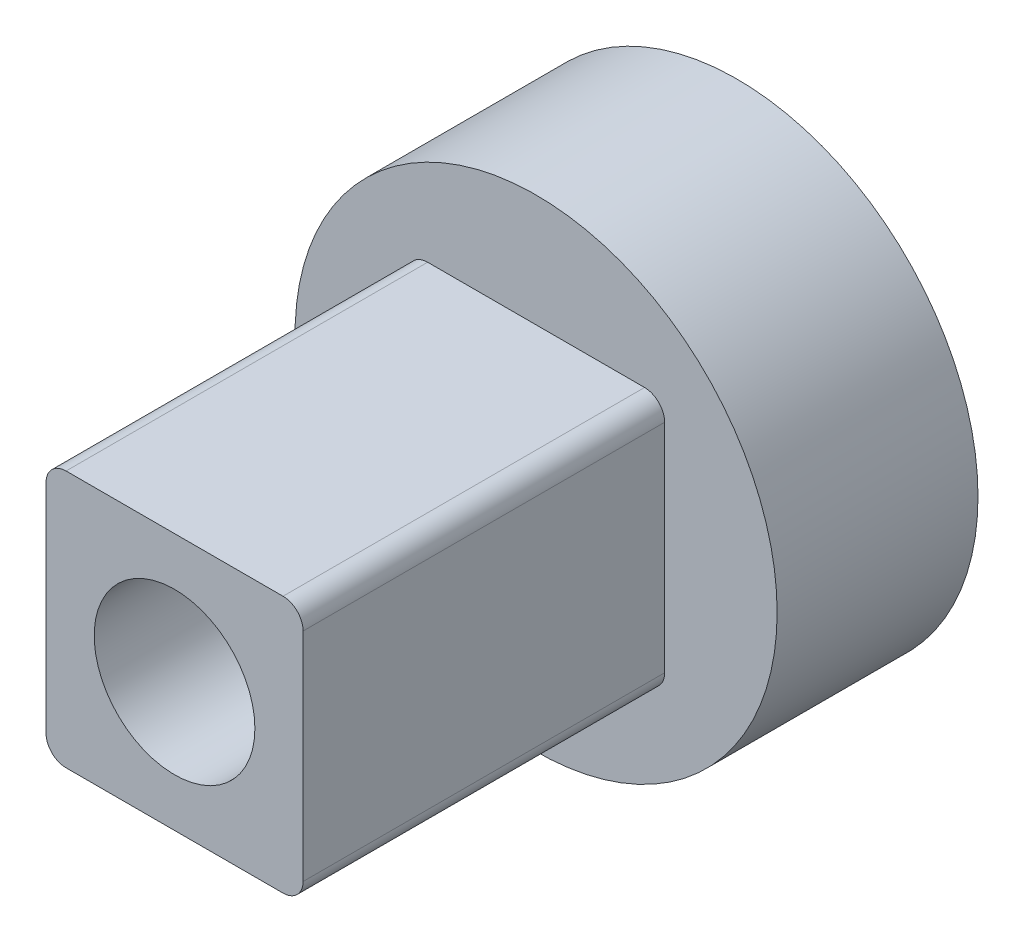
ISO-10303-21;
HEADER;
FILE_DESCRIPTION(('STEP AP214'),'2;1');
FILE_NAME('part.step','',(''),(''),'','','');
FILE_SCHEMA(('AUTOMOTIVE_DESIGN { 1 0 10303 214 1 1 1 1 }'));
ENDSEC;
DATA;
#1=APPLICATION_CONTEXT('core data for automotive mechanical design processes');
#2=APPLICATION_PROTOCOL_DEFINITION('international standard','automotive_design',2000,#1);
#3=PRODUCT_CONTEXT('',#1,'mechanical');
#4=PRODUCT('Part','Part','',(#3));
#5=PRODUCT_RELATED_PRODUCT_CATEGORY('part','',(#4));
#6=PRODUCT_DEFINITION_FORMATION('','',#4);
#7=PRODUCT_DEFINITION_CONTEXT('part definition',#1,'design');
#8=PRODUCT_DEFINITION('design','',#6,#7);
#9=PRODUCT_DEFINITION_SHAPE('','',#8);
#10=(LENGTH_UNIT() NAMED_UNIT(*) SI_UNIT(.MILLI.,.METRE.));
#11=(NAMED_UNIT(*) PLANE_ANGLE_UNIT() SI_UNIT($,.RADIAN.));
#12=(NAMED_UNIT(*) SI_UNIT($,.STERADIAN.) SOLID_ANGLE_UNIT());
#13=UNCERTAINTY_MEASURE_WITH_UNIT(LENGTH_MEASURE(1.E-05),#10,'distance_accuracy_value','');
#14=(GEOMETRIC_REPRESENTATION_CONTEXT(3) GLOBAL_UNCERTAINTY_ASSIGNED_CONTEXT((#13)) GLOBAL_UNIT_ASSIGNED_CONTEXT((#10,
#11,#12)) REPRESENTATION_CONTEXT('',''));
#15=CARTESIAN_POINT('',(0.,0.,0.));
#16=DIRECTION('',(0.,0.,1.));
#17=DIRECTION('',(1.,0.,0.));
#18=AXIS2_PLACEMENT_3D('',#15,#16,#17);
#19=CARTESIAN_POINT('',(3.74045726375708,-31.8283867787404,-23.4664713525207));
#20=DIRECTION('',(0.,0.,1.));
#21=DIRECTION('',(1.,0.,0.));
#22=AXIS2_PLACEMENT_3D('',#19,#20,#21);
#23=CYLINDRICAL_SURFACE('',#22,1.);
#24=CARTESIAN_POINT('',(3.74045726375708,-31.8283867787404,-18.4654713525207));
#25=DIRECTION('',(0.,0.,-1.));
#26=DIRECTION('',(-1.,0.,0.));
#27=AXIS2_PLACEMENT_3D('',#24,#25,#26);
#28=CIRCLE('',#27,1.);
#29=CARTESIAN_POINT('',(2.74045726375708,-31.8283867787404,-18.4654713525207));
#30=VERTEX_POINT('',#29);
#31=EDGE_CURVE('E138',#30,#30,#28,.F.);
#32=ORIENTED_EDGE('',*,*,#31,.F.);
#33=EDGE_LOOP('',(#32));
#34=FACE_BOUND('',#33,.T.);
#35=CARTESIAN_POINT('',(3.74045726375708,-31.8283867787404,-16.4654713525207));
#36=DIRECTION('',(0.,0.,1.));
#37=DIRECTION('',(1.,0.,0.));
#38=AXIS2_PLACEMENT_3D('',#35,#36,#37);
#39=CIRCLE('',#38,1.);
#40=CARTESIAN_POINT('',(4.74045726375708,-31.8283867787404,-16.4654713525207));
#41=VERTEX_POINT('',#40);
#42=EDGE_CURVE('E40',#41,#41,#39,.F.);
#43=ORIENTED_EDGE('',*,*,#42,.F.);
#44=EDGE_LOOP('',(#43));
#45=FACE_BOUND('',#44,.T.);
#46=ADVANCED_FACE('F36',(#34,#45),#23,.F.);
#47=CARTESIAN_POINT('',(3.74045730835774,-31.8283867787375,-18.4654713525207));
#48=DIRECTION('',(0.,0.,1.));
#49=DIRECTION('',(1.,0.,0.));
#50=AXIS2_PLACEMENT_3D('',#47,#48,#49);
#51=PLANE('',#50);
#52=CARTESIAN_POINT('',(3.74045730835774,-31.8283867787375,-18.4654713525207));
#53=DIRECTION('',(0.,0.,1.));
#54=DIRECTION('',(1.,0.,0.));
#55=AXIS2_PLACEMENT_3D('',#52,#53,#54);
#56=CIRCLE('',#55,6.);
#57=CARTESIAN_POINT('',(9.74045730835774,-31.8283867787375,-18.4654713525207));
#58=VERTEX_POINT('',#57);
#59=EDGE_CURVE('E13',#58,#58,#56,.T.);
#60=ORIENTED_EDGE('',*,*,#59,.T.);
#61=EDGE_LOOP('',(#60));
#62=FACE_BOUND('',#61,.T.);
#63=DIRECTION('',(0.,-1.,0.));
#64=VECTOR('',#63,1.);
#65=CARTESIAN_POINT('',(0.540457308357729,-29.1283867787375,-18.4654713525207));
#66=LINE('',#65,#64);
#67=CARTESIAN_POINT('',(0.540457308357729,-29.1283867787375,-18.4654713525207));
#68=VERTEX_POINT('',#67);
#69=CARTESIAN_POINT('',(0.54045730835773,-34.5283867787375,-18.4654713525207));
#70=VERTEX_POINT('',#69);
#71=EDGE_CURVE('E137',#68,#70,#66,.T.);
#72=ORIENTED_EDGE('',*,*,#71,.F.);
#73=CARTESIAN_POINT('',(1.04045730835773,-29.1283867787375,-18.4654713525207));
#74=DIRECTION('',(0.,0.,1.));
#75=DIRECTION('',(-1.,0.,0.));
#76=AXIS2_PLACEMENT_3D('',#73,#74,#75);
#77=CIRCLE('',#76,0.5);
#78=CARTESIAN_POINT('',(1.04045730835773,-28.6283867787375,-18.4654713525207));
#79=VERTEX_POINT('',#78);
#80=EDGE_CURVE('E134',#79,#68,#77,.T.);
#81=ORIENTED_EDGE('',*,*,#80,.F.);
#82=DIRECTION('',(-1.,0.,0.));
#83=VECTOR('',#82,1.);
#84=CARTESIAN_POINT('',(6.44045730835773,-28.6283867787375,-18.4654713525207));
#85=LINE('',#84,#83);
#86=CARTESIAN_POINT('',(6.44045730835773,-28.6283867787375,-18.4654713525207));
#87=VERTEX_POINT('',#86);
#88=EDGE_CURVE('E87',#87,#79,#85,.T.);
#89=ORIENTED_EDGE('',*,*,#88,.F.);
#90=CARTESIAN_POINT('',(6.44045730835773,-29.1283867787375,-18.4654713525207));
#91=DIRECTION('',(0.,0.,1.));
#92=DIRECTION('',(-1.,0.,0.));
#93=AXIS2_PLACEMENT_3D('',#90,#91,#92);
#94=CIRCLE('',#93,0.5);
#95=CARTESIAN_POINT('',(6.94045730835773,-29.1283867787375,-18.4654713525207));
#96=VERTEX_POINT('',#95);
#97=EDGE_CURVE('E147',#96,#87,#94,.T.);
#98=ORIENTED_EDGE('',*,*,#97,.F.);
#99=DIRECTION('',(0.,1.,0.));
#100=VECTOR('',#99,1.);
#101=CARTESIAN_POINT('',(6.94045730835773,-29.1283867787375,-18.4654713525207));
#102=LINE('',#101,#100);
#103=CARTESIAN_POINT('',(6.94045730835773,-34.5283867787375,-18.4654713525207));
#104=VERTEX_POINT('',#103);
#105=EDGE_CURVE('E123',#104,#96,#102,.T.);
#106=ORIENTED_EDGE('',*,*,#105,.F.);
#107=CARTESIAN_POINT('',(6.44045730835773,-34.5283867787375,-18.4654713525207));
#108=DIRECTION('',(0.,0.,1.));
#109=DIRECTION('',(1.,0.,0.));
#110=AXIS2_PLACEMENT_3D('',#107,#108,#109);
#111=CIRCLE('',#110,0.5);
#112=CARTESIAN_POINT('',(6.44045730835773,-35.0283867787375,-18.4654713525207));
#113=VERTEX_POINT('',#112);
#114=EDGE_CURVE('E144',#113,#104,#111,.T.);
#115=ORIENTED_EDGE('',*,*,#114,.F.);
#116=DIRECTION('',(1.,0.,0.));
#117=VECTOR('',#116,1.);
#118=CARTESIAN_POINT('',(6.44045730835773,-35.0283867787375,-18.4654713525207));
#119=LINE('',#118,#117);
#120=CARTESIAN_POINT('',(1.04045730835773,-35.0283867787375,-18.4654713525207));
#121=VERTEX_POINT('',#120);
#122=EDGE_CURVE('E142',#121,#113,#119,.T.);
#123=ORIENTED_EDGE('',*,*,#122,.F.);
#124=CARTESIAN_POINT('',(1.04045730835773,-34.5283867787375,-18.4654713525207));
#125=DIRECTION('',(0.,0.,1.));
#126=DIRECTION('',(-1.,0.,0.));
#127=AXIS2_PLACEMENT_3D('',#124,#125,#126);
#128=CIRCLE('',#127,0.500000000000001);
#129=EDGE_CURVE('E140',#70,#121,#128,.T.);
#130=ORIENTED_EDGE('',*,*,#129,.F.);
#131=EDGE_LOOP('',(#72,#81,#89,#98,#106,#115,#123,#130));
#132=FACE_BOUND('',#131,.T.);
#133=ADVANCED_FACE('F177',(#62,#132),#51,.T.);
#134=CARTESIAN_POINT('',(3.74045730835774,-31.8283867787375,-23.4654713525207));
#135=DIRECTION('',(0.,0.,1.));
#136=DIRECTION('',(1.,0.,0.));
#137=AXIS2_PLACEMENT_3D('',#134,#135,#136);
#138=PLANE('',#137);
#139=CARTESIAN_POINT('',(3.74045730835774,-31.8283867787375,-23.4654713525207));
#140=DIRECTION('',(0.,0.,1.));
#141=DIRECTION('',(1.,0.,0.));
#142=AXIS2_PLACEMENT_3D('',#139,#140,#141);
#143=CIRCLE('',#142,6.);
#144=CARTESIAN_POINT('',(9.74045730835774,-31.8283867787375,-23.4654713525207));
#145=VERTEX_POINT('',#144);
#146=EDGE_CURVE('E45',#145,#145,#143,.T.);
#147=ORIENTED_EDGE('',*,*,#146,.F.);
#148=EDGE_LOOP('',(#147));
#149=FACE_BOUND('',#148,.T.);
#150=CARTESIAN_POINT('',(3.74045730835774,-31.8283867787375,-23.4654713525207));
#151=DIRECTION('',(0.,0.,1.));
#152=DIRECTION('',(1.,0.,0.));
#153=AXIS2_PLACEMENT_3D('',#150,#151,#152);
#154=CIRCLE('',#153,2.4);
#155=CARTESIAN_POINT('',(6.14045730835774,-31.8283867787375,-23.4654713525207));
#156=VERTEX_POINT('',#155);
#157=EDGE_CURVE('E168',#156,#156,#154,.T.);
#158=ORIENTED_EDGE('',*,*,#157,.T.);
#159=EDGE_LOOP('',(#158));
#160=FACE_BOUND('',#159,.T.);
#161=ADVANCED_FACE('F174',(#149,#160),#138,.F.);
#162=CARTESIAN_POINT('',(3.74045730835774,-31.8283867787375,-18.4654713525207));
#163=DIRECTION('',(0.,0.,-1.));
#164=DIRECTION('',(-1.,0.,0.));
#165=AXIS2_PLACEMENT_3D('',#162,#163,#164);
#166=CYLINDRICAL_SURFACE('',#165,6.);
#167=ORIENTED_EDGE('',*,*,#59,.F.);
#168=EDGE_LOOP('',(#167));
#169=FACE_BOUND('',#168,.T.);
#170=ORIENTED_EDGE('',*,*,#146,.T.);
#171=EDGE_LOOP('',(#170));
#172=FACE_BOUND('',#171,.T.);
#173=ADVANCED_FACE('F38',(#169,#172),#166,.T.);
#174=CARTESIAN_POINT('',(3.74045730835774,-31.8283867787375,-18.4654713525207));
#175=DIRECTION('',(0.,0.,-1.));
#176=DIRECTION('',(-1.,0.,0.));
#177=AXIS2_PLACEMENT_3D('',#174,#175,#176);
#178=CYLINDRICAL_SURFACE('',#177,2.4);
#179=CARTESIAN_POINT('',(3.74045730835774,-31.8283867787375,-18.4654713525207));
#180=DIRECTION('',(0.,0.,-1.));
#181=DIRECTION('',(-1.,0.,0.));
#182=AXIS2_PLACEMENT_3D('',#179,#180,#181);
#183=CIRCLE('',#182,2.4);
#184=CARTESIAN_POINT('',(1.34045730835774,-31.8283867787375,-18.4654713525207));
#185=VERTEX_POINT('',#184);
#186=EDGE_CURVE('E165',#185,#185,#183,.T.);
#187=ORIENTED_EDGE('',*,*,#186,.F.);
#188=EDGE_LOOP('',(#187));
#189=FACE_BOUND('',#188,.T.);
#190=ORIENTED_EDGE('',*,*,#157,.F.);
#191=EDGE_LOOP('',(#190));
#192=FACE_BOUND('',#191,.T.);
#193=ADVANCED_FACE('F180',(#189,#192),#178,.F.);
#194=CARTESIAN_POINT('',(1.04045730835773,-29.1283867787375,-18.4654713525207));
#195=DIRECTION('',(0.,0.,-1.));
#196=DIRECTION('',(-1.,0.,0.));
#197=AXIS2_PLACEMENT_3D('',#194,#195,#196);
#198=PLANE('',#197);
#199=ORIENTED_EDGE('',*,*,#31,.T.);
#200=EDGE_LOOP('',(#199));
#201=FACE_BOUND('',#200,.T.);
#202=ORIENTED_EDGE('',*,*,#186,.T.);
#203=EDGE_LOOP('',(#202));
#204=FACE_BOUND('',#203,.T.);
#205=ADVANCED_FACE('F182',(#201,#204),#198,.T.);
#206=CARTESIAN_POINT('',(1.04045730835773,-29.1283867787375,-9.46547135252071));
#207=DIRECTION('',(0.,0.,-1.));
#208=DIRECTION('',(-1.,0.,0.));
#209=AXIS2_PLACEMENT_3D('',#206,#207,#208);
#210=CYLINDRICAL_SURFACE('',#209,0.5);
#211=ORIENTED_EDGE('',*,*,#80,.T.);
#212=DIRECTION('',(0.,0.,-1.));
#213=VECTOR('',#212,1.);
#214=CARTESIAN_POINT('',(0.540457308357729,-29.1283867787375,-9.46547135252071));
#215=LINE('',#214,#213);
#216=CARTESIAN_POINT('',(0.540457308357729,-29.1283867787375,-9.46547135252071));
#217=VERTEX_POINT('',#216);
#218=EDGE_CURVE('E163',#217,#68,#215,.T.);
#219=ORIENTED_EDGE('',*,*,#218,.F.);
#220=CARTESIAN_POINT('',(1.04045730835773,-29.1283867787375,-9.46547135252071));
#221=DIRECTION('',(0.,0.,1.));
#222=DIRECTION('',(-1.,0.,0.));
#223=AXIS2_PLACEMENT_3D('',#220,#221,#222);
#224=CIRCLE('',#223,0.5);
#225=CARTESIAN_POINT('',(1.04045730835773,-28.6283867787375,-9.46547135252071));
#226=VERTEX_POINT('',#225);
#227=EDGE_CURVE('E150',#226,#217,#224,.T.);
#228=ORIENTED_EDGE('',*,*,#227,.F.);
#229=DIRECTION('',(0.,0.,-1.));
#230=VECTOR('',#229,1.);
#231=CARTESIAN_POINT('',(1.04045730835773,-28.6283867787375,-9.46547135252071));
#232=LINE('',#231,#230);
#233=EDGE_CURVE('E130',#226,#79,#232,.T.);
#234=ORIENTED_EDGE('',*,*,#233,.T.);
#235=EDGE_LOOP('',(#211,#219,#228,#234));
#236=FACE_BOUND('',#235,.T.);
#237=ADVANCED_FACE('F190',(#236),#210,.T.);
#238=CARTESIAN_POINT('',(0.540457308357729,-29.1283867787375,-9.46547135252071));
#239=DIRECTION('',(1.,0.,0.));
#240=DIRECTION('',(0.,1.,0.));
#241=AXIS2_PLACEMENT_3D('',#238,#239,#240);
#242=PLANE('',#241);
#243=ORIENTED_EDGE('',*,*,#71,.T.);
#244=DIRECTION('',(0.,0.,-1.));
#245=VECTOR('',#244,1.);
#246=CARTESIAN_POINT('',(0.54045730835773,-34.5283867787375,-9.46547135252071));
#247=LINE('',#246,#245);
#248=CARTESIAN_POINT('',(0.54045730835773,-34.5283867787375,-9.46547135252071));
#249=VERTEX_POINT('',#248);
#250=EDGE_CURVE('E160',#249,#70,#247,.T.);
#251=ORIENTED_EDGE('',*,*,#250,.F.);
#252=DIRECTION('',(0.,-1.,0.));
#253=VECTOR('',#252,1.);
#254=CARTESIAN_POINT('',(0.540457308357729,-29.1283867787375,-9.46547135252071));
#255=LINE('',#254,#253);
#256=EDGE_CURVE('E95',#217,#249,#255,.T.);
#257=ORIENTED_EDGE('',*,*,#256,.F.);
#258=ORIENTED_EDGE('',*,*,#218,.T.);
#259=EDGE_LOOP('',(#243,#251,#257,#258));
#260=FACE_BOUND('',#259,.T.);
#261=ADVANCED_FACE('F234',(#260),#242,.F.);
#262=CARTESIAN_POINT('',(1.04045730835773,-34.5283867787375,-9.46547135252071));
#263=DIRECTION('',(0.,0.,-1.));
#264=DIRECTION('',(-1.,0.,0.));
#265=AXIS2_PLACEMENT_3D('',#262,#263,#264);
#266=CYLINDRICAL_SURFACE('',#265,0.500000000000001);
#267=ORIENTED_EDGE('',*,*,#129,.T.);
#268=DIRECTION('',(0.,0.,-1.));
#269=VECTOR('',#268,1.);
#270=CARTESIAN_POINT('',(1.04045730835773,-35.0283867787375,-9.46547135252071));
#271=LINE('',#270,#269);
#272=CARTESIAN_POINT('',(1.04045730835773,-35.0283867787375,-9.46547135252071));
#273=VERTEX_POINT('',#272);
#274=EDGE_CURVE('E157',#273,#121,#271,.T.);
#275=ORIENTED_EDGE('',*,*,#274,.F.);
#276=CARTESIAN_POINT('',(1.04045730835773,-34.5283867787375,-9.46547135252071));
#277=DIRECTION('',(0.,0.,1.));
#278=DIRECTION('',(-1.,0.,0.));
#279=AXIS2_PLACEMENT_3D('',#276,#277,#278);
#280=CIRCLE('',#279,0.500000000000001);
#281=EDGE_CURVE('E250',#249,#273,#280,.T.);
#282=ORIENTED_EDGE('',*,*,#281,.F.);
#283=ORIENTED_EDGE('',*,*,#250,.T.);
#284=EDGE_LOOP('',(#267,#275,#282,#283));
#285=FACE_BOUND('',#284,.T.);
#286=ADVANCED_FACE('F230',(#285),#266,.T.);
#287=CARTESIAN_POINT('',(6.44045730835773,-35.0283867787375,-9.46547135252071));
#288=DIRECTION('',(0.,1.,0.));
#289=DIRECTION('',(0.,0.,1.));
#290=AXIS2_PLACEMENT_3D('',#287,#288,#289);
#291=PLANE('',#290);
#292=ORIENTED_EDGE('',*,*,#122,.T.);
#293=DIRECTION('',(0.,0.,-1.));
#294=VECTOR('',#293,1.);
#295=CARTESIAN_POINT('',(6.44045730835773,-35.0283867787375,-9.46547135252071));
#296=LINE('',#295,#294);
#297=CARTESIAN_POINT('',(6.44045730835773,-35.0283867787375,-9.46547135252071));
#298=VERTEX_POINT('',#297);
#299=EDGE_CURVE('E154',#298,#113,#296,.T.);
#300=ORIENTED_EDGE('',*,*,#299,.F.);
#301=DIRECTION('',(1.,0.,0.));
#302=VECTOR('',#301,1.);
#303=CARTESIAN_POINT('',(6.44045730835773,-35.0283867787375,-9.46547135252071));
#304=LINE('',#303,#302);
#305=EDGE_CURVE('E252',#273,#298,#304,.T.);
#306=ORIENTED_EDGE('',*,*,#305,.F.);
#307=ORIENTED_EDGE('',*,*,#274,.T.);
#308=EDGE_LOOP('',(#292,#300,#306,#307));
#309=FACE_BOUND('',#308,.T.);
#310=ADVANCED_FACE('F226',(#309),#291,.F.);
#311=CARTESIAN_POINT('',(6.44045730835773,-34.5283867787375,-9.46547135252071));
#312=DIRECTION('',(0.,0.,-1.));
#313=DIRECTION('',(-1.,0.,0.));
#314=AXIS2_PLACEMENT_3D('',#311,#312,#313);
#315=CYLINDRICAL_SURFACE('',#314,0.5);
#316=ORIENTED_EDGE('',*,*,#114,.T.);
#317=DIRECTION('',(0.,0.,-1.));
#318=VECTOR('',#317,1.);
#319=CARTESIAN_POINT('',(6.94045730835773,-34.5283867787375,-9.46547135252071));
#320=LINE('',#319,#318);
#321=CARTESIAN_POINT('',(6.94045730835773,-34.5283867787375,-9.46547135252071));
#322=VERTEX_POINT('',#321);
#323=EDGE_CURVE('E126',#322,#104,#320,.T.);
#324=ORIENTED_EDGE('',*,*,#323,.F.);
#325=CARTESIAN_POINT('',(6.44045730835773,-34.5283867787375,-9.46547135252071));
#326=DIRECTION('',(0.,0.,1.));
#327=DIRECTION('',(1.,0.,0.));
#328=AXIS2_PLACEMENT_3D('',#325,#326,#327);
#329=CIRCLE('',#328,0.5);
#330=EDGE_CURVE('E114',#298,#322,#329,.T.);
#331=ORIENTED_EDGE('',*,*,#330,.F.);
#332=ORIENTED_EDGE('',*,*,#299,.T.);
#333=EDGE_LOOP('',(#316,#324,#331,#332));
#334=FACE_BOUND('',#333,.T.);
#335=ADVANCED_FACE('F223',(#334),#315,.T.);
#336=CARTESIAN_POINT('',(6.94045730835773,-29.1283867787375,-9.46547135252071));
#337=DIRECTION('',(-1.,0.,0.));
#338=DIRECTION('',(0.,-1.,0.));
#339=AXIS2_PLACEMENT_3D('',#336,#337,#338);
#340=PLANE('',#339);
#341=ORIENTED_EDGE('',*,*,#105,.T.);
#342=DIRECTION('',(0.,0.,-1.));
#343=VECTOR('',#342,1.);
#344=CARTESIAN_POINT('',(6.94045730835773,-29.1283867787375,-9.46547135252071));
#345=LINE('',#344,#343);
#346=CARTESIAN_POINT('',(6.94045730835773,-29.1283867787375,-9.46547135252071));
#347=VERTEX_POINT('',#346);
#348=EDGE_CURVE('E120',#347,#96,#345,.T.);
#349=ORIENTED_EDGE('',*,*,#348,.F.);
#350=DIRECTION('',(0.,1.,0.));
#351=VECTOR('',#350,1.);
#352=CARTESIAN_POINT('',(6.94045730835773,-29.1283867787375,-9.46547135252071));
#353=LINE('',#352,#351);
#354=EDGE_CURVE('E108',#322,#347,#353,.T.);
#355=ORIENTED_EDGE('',*,*,#354,.F.);
#356=ORIENTED_EDGE('',*,*,#323,.T.);
#357=EDGE_LOOP('',(#341,#349,#355,#356));
#358=FACE_BOUND('',#357,.T.);
#359=ADVANCED_FACE('F121',(#358),#340,.F.);
#360=CARTESIAN_POINT('',(6.44045730835773,-29.1283867787375,-9.46547135252071));
#361=DIRECTION('',(0.,0.,-1.));
#362=DIRECTION('',(-1.,0.,0.));
#363=AXIS2_PLACEMENT_3D('',#360,#361,#362);
#364=CYLINDRICAL_SURFACE('',#363,0.5);
#365=ORIENTED_EDGE('',*,*,#97,.T.);
#366=DIRECTION('',(0.,0.,-1.));
#367=VECTOR('',#366,1.);
#368=CARTESIAN_POINT('',(6.44045730835773,-28.6283867787375,-9.46547135252071));
#369=LINE('',#368,#367);
#370=CARTESIAN_POINT('',(6.44045730835773,-28.6283867787375,-9.46547135252071));
#371=VERTEX_POINT('',#370);
#372=EDGE_CURVE('E53',#371,#87,#369,.T.);
#373=ORIENTED_EDGE('',*,*,#372,.F.);
#374=CARTESIAN_POINT('',(6.44045730835773,-29.1283867787375,-9.46547135252071));
#375=DIRECTION('',(0.,0.,1.));
#376=DIRECTION('',(-1.,0.,0.));
#377=AXIS2_PLACEMENT_3D('',#374,#375,#376);
#378=CIRCLE('',#377,0.5);
#379=EDGE_CURVE('E112',#347,#371,#378,.T.);
#380=ORIENTED_EDGE('',*,*,#379,.F.);
#381=ORIENTED_EDGE('',*,*,#348,.T.);
#382=EDGE_LOOP('',(#365,#373,#380,#381));
#383=FACE_BOUND('',#382,.T.);
#384=ADVANCED_FACE('F128',(#383),#364,.T.);
#385=CARTESIAN_POINT('',(6.44045730835773,-28.6283867787375,-9.46547135252071));
#386=DIRECTION('',(0.,-1.,0.));
#387=DIRECTION('',(0.,0.,-1.));
#388=AXIS2_PLACEMENT_3D('',#385,#386,#387);
#389=PLANE('',#388);
#390=ORIENTED_EDGE('',*,*,#88,.T.);
#391=ORIENTED_EDGE('',*,*,#233,.F.);
#392=DIRECTION('',(-1.,0.,0.));
#393=VECTOR('',#392,1.);
#394=CARTESIAN_POINT('',(6.44045730835773,-28.6283867787375,-9.46547135252071));
#395=LINE('',#394,#393);
#396=EDGE_CURVE('E61',#371,#226,#395,.T.);
#397=ORIENTED_EDGE('',*,*,#396,.F.);
#398=ORIENTED_EDGE('',*,*,#372,.T.);
#399=EDGE_LOOP('',(#390,#391,#397,#398));
#400=FACE_BOUND('',#399,.T.);
#401=ADVANCED_FACE('F214',(#400),#389,.F.);
#402=CARTESIAN_POINT('',(1.04045730835773,-29.1283867787375,-9.46547135252071));
#403=DIRECTION('',(0.,0.,-1.));
#404=DIRECTION('',(-1.,0.,0.));
#405=AXIS2_PLACEMENT_3D('',#402,#403,#404);
#406=PLANE('',#405);
#407=CARTESIAN_POINT('',(3.74045726365417,-31.8283867787374,-9.46547135252071));
#408=DIRECTION('',(0.,0.,1.));
#409=DIRECTION('',(1.,0.,0.));
#410=AXIS2_PLACEMENT_3D('',#407,#408,#409);
#411=CIRCLE('',#410,2.);
#412=CARTESIAN_POINT('',(5.74045726365418,-31.8283867787374,-9.46547135252071));
#413=VERTEX_POINT('',#412);
#414=EDGE_CURVE('E263',#413,#413,#411,.T.);
#415=ORIENTED_EDGE('',*,*,#414,.F.);
#416=EDGE_LOOP('',(#415));
#417=FACE_BOUND('',#416,.T.);
#418=ORIENTED_EDGE('',*,*,#227,.T.);
#419=ORIENTED_EDGE('',*,*,#256,.T.);
#420=ORIENTED_EDGE('',*,*,#281,.T.);
#421=ORIENTED_EDGE('',*,*,#305,.T.);
#422=ORIENTED_EDGE('',*,*,#330,.T.);
#423=ORIENTED_EDGE('',*,*,#354,.T.);
#424=ORIENTED_EDGE('',*,*,#379,.T.);
#425=ORIENTED_EDGE('',*,*,#396,.T.);
#426=EDGE_LOOP('',(#418,#419,#420,#421,#422,#423,#424,#425));
#427=FACE_BOUND('',#426,.T.);
#428=ADVANCED_FACE('F110',(#417,#427),#406,.F.);
#429=CARTESIAN_POINT('',(3.74045730835774,-31.8283867787375,-16.4654713525207));
#430=DIRECTION('',(0.,0.,1.));
#431=DIRECTION('',(1.,0.,0.));
#432=AXIS2_PLACEMENT_3D('',#429,#430,#431);
#433=PLANE('',#432);
#434=CARTESIAN_POINT('',(3.74045726365417,-31.8283867787374,-16.4654713525207));
#435=DIRECTION('',(0.,0.,1.));
#436=DIRECTION('',(1.,0.,0.));
#437=AXIS2_PLACEMENT_3D('',#434,#435,#436);
#438=CIRCLE('',#437,2.);
#439=CARTESIAN_POINT('',(5.74045726365418,-31.8283867787374,-16.4654713525207));
#440=VERTEX_POINT('',#439);
#441=EDGE_CURVE('E260',#440,#440,#438,.F.);
#442=ORIENTED_EDGE('',*,*,#441,.F.);
#443=EDGE_LOOP('',(#442));
#444=FACE_BOUND('',#443,.T.);
#445=ORIENTED_EDGE('',*,*,#42,.T.);
#446=EDGE_LOOP('',(#445));
#447=FACE_BOUND('',#446,.T.);
#448=ADVANCED_FACE('F213',(#444,#447),#433,.T.);
#449=CARTESIAN_POINT('',(3.74045726365417,-31.8283867787374,-24.1223256020131));
#450=DIRECTION('',(0.,0.,1.));
#451=DIRECTION('',(1.,0.,0.));
#452=AXIS2_PLACEMENT_3D('',#449,#450,#451);
#453=CYLINDRICAL_SURFACE('',#452,2.);
#454=ORIENTED_EDGE('',*,*,#441,.T.);
#455=EDGE_LOOP('',(#454));
#456=FACE_BOUND('',#455,.T.);
#457=ORIENTED_EDGE('',*,*,#414,.T.);
#458=EDGE_LOOP('',(#457));
#459=FACE_BOUND('',#458,.T.);
#460=ADVANCED_FACE('F210',(#456,#459),#453,.F.);
#461=CLOSED_SHELL('',(#46,#133,#161,#173,#193,#205,#237,#261,#286,#310,#335,#359,#384,#401,#428,
#448,#460));
#462=MANIFOLD_SOLID_BREP('B2',#461);
#463=ADVANCED_BREP_SHAPE_REPRESENTATION('',(#18,#462),#14);
#464=SHAPE_DEFINITION_REPRESENTATION(#9,#463);
ENDSEC;
END-ISO-10303-21;
